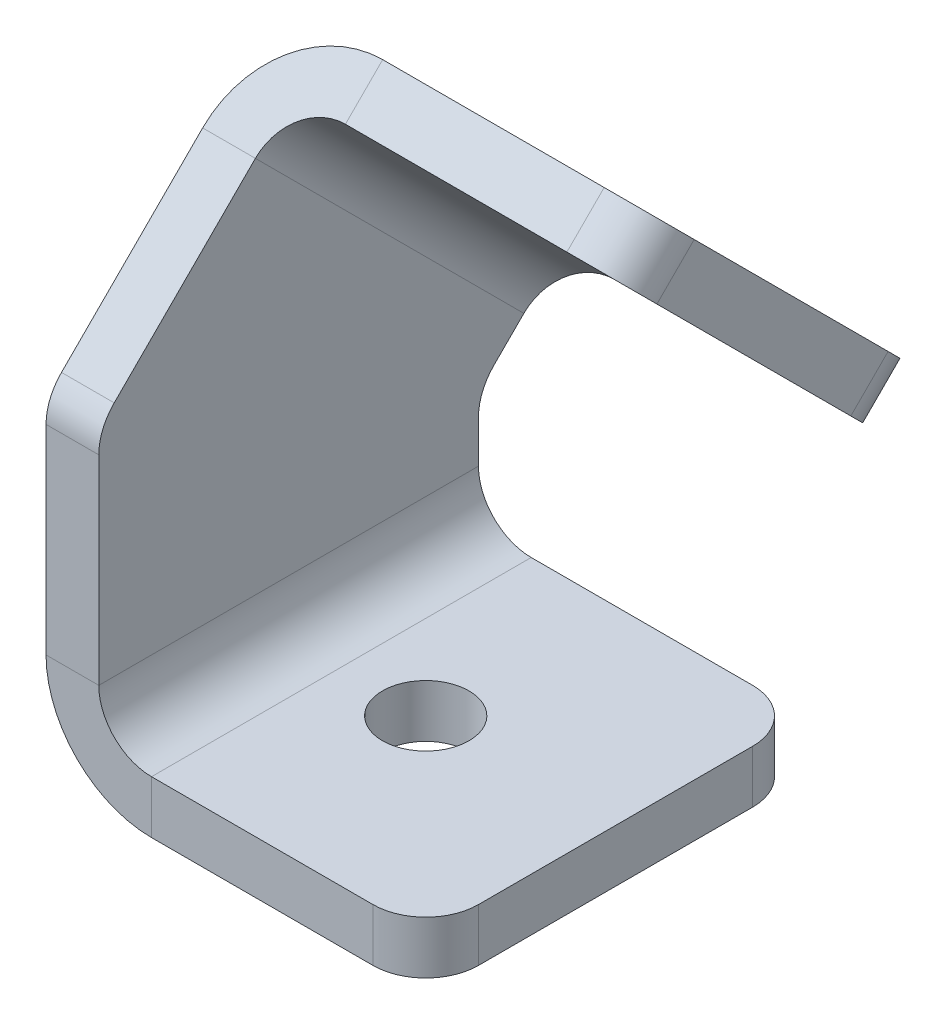
ISO-10303-21;
HEADER;
FILE_DESCRIPTION(('STEP AP214'),'2;1');
FILE_NAME('part.step','',(''),(''),'','','');
FILE_SCHEMA(('AUTOMOTIVE_DESIGN { 1 0 10303 214 1 1 1 1 }'));
ENDSEC;
DATA;
#1=APPLICATION_CONTEXT('core data for automotive mechanical design processes');
#2=APPLICATION_PROTOCOL_DEFINITION('international standard','automotive_design',2000,#1);
#3=PRODUCT_CONTEXT('',#1,'mechanical');
#4=PRODUCT('Part','Part','',(#3));
#5=PRODUCT_RELATED_PRODUCT_CATEGORY('part','',(#4));
#6=PRODUCT_DEFINITION_FORMATION('','',#4);
#7=PRODUCT_DEFINITION_CONTEXT('part definition',#1,'design');
#8=PRODUCT_DEFINITION('design','',#6,#7);
#9=PRODUCT_DEFINITION_SHAPE('','',#8);
#10=(LENGTH_UNIT() NAMED_UNIT(*) SI_UNIT(.MILLI.,.METRE.));
#11=(NAMED_UNIT(*) PLANE_ANGLE_UNIT() SI_UNIT($,.RADIAN.));
#12=(NAMED_UNIT(*) SI_UNIT($,.STERADIAN.) SOLID_ANGLE_UNIT());
#13=UNCERTAINTY_MEASURE_WITH_UNIT(LENGTH_MEASURE(1.E-05),#10,'distance_accuracy_value','');
#14=(GEOMETRIC_REPRESENTATION_CONTEXT(3) GLOBAL_UNCERTAINTY_ASSIGNED_CONTEXT((#13)) GLOBAL_UNIT_ASSIGNED_CONTEXT((#10,
#11,#12)) REPRESENTATION_CONTEXT('',''));
#15=CARTESIAN_POINT('',(0.,0.,0.));
#16=DIRECTION('',(0.,0.,1.));
#17=DIRECTION('',(1.,0.,0.));
#18=AXIS2_PLACEMENT_3D('',#15,#16,#17);
#19=CARTESIAN_POINT('',(5.,28.9289321881345,31.));
#20=DIRECTION('',(1.,0.,0.));
#21=DIRECTION('',(0.,0.,-1.));
#22=AXIS2_PLACEMENT_3D('',#19,#20,#21);
#23=CYLINDRICAL_SURFACE('',#22,5.);
#24=DIRECTION('',(1.,0.,0.));
#25=VECTOR('',#24,1.);
#26=CARTESIAN_POINT('',(5.,32.4644660940673,34.5355339059327));
#27=LINE('',#26,#25);
#28=CARTESIAN_POINT('',(0.,32.4644660940673,34.5355339059327));
#29=VERTEX_POINT('',#28);
#30=CARTESIAN_POINT('',(5.,32.4644660940673,34.5355339059327));
#31=VERTEX_POINT('',#30);
#32=EDGE_CURVE('E10',#29,#31,#27,.T.);
#33=ORIENTED_EDGE('',*,*,#32,.F.);
#34=CARTESIAN_POINT('',(0.,28.9289321881345,31.));
#35=DIRECTION('',(1.,0.,0.));
#36=DIRECTION('',(0.,0.,-1.));
#37=AXIS2_PLACEMENT_3D('',#34,#35,#36);
#38=CIRCLE('',#37,5.);
#39=CARTESIAN_POINT('',(0.,28.9289321881345,36.));
#40=VERTEX_POINT('',#39);
#41=EDGE_CURVE('E136',#29,#40,#38,.T.);
#42=ORIENTED_EDGE('',*,*,#41,.T.);
#43=DIRECTION('',(1.,0.,0.));
#44=VECTOR('',#43,1.);
#45=CARTESIAN_POINT('',(5.,28.9289321881345,36.));
#46=LINE('',#45,#44);
#47=CARTESIAN_POINT('',(5.,28.9289321881345,36.));
#48=VERTEX_POINT('',#47);
#49=EDGE_CURVE('E26',#40,#48,#46,.T.);
#50=ORIENTED_EDGE('',*,*,#49,.T.);
#51=CARTESIAN_POINT('',(5.,28.9289321881345,31.));
#52=DIRECTION('',(1.,0.,0.));
#53=DIRECTION('',(0.,0.,-1.));
#54=AXIS2_PLACEMENT_3D('',#51,#52,#53);
#55=CIRCLE('',#54,5.);
#56=EDGE_CURVE('E254',#31,#48,#55,.T.);
#57=ORIENTED_EDGE('',*,*,#56,.F.);
#58=EDGE_LOOP('',(#33,#42,#50,#57));
#59=FACE_BOUND('',#58,.T.);
#60=ADVANCED_FACE('F16',(#59),#23,.T.);
#61=CARTESIAN_POINT('',(5.,0.,36.));
#62=DIRECTION('',(0.,0.,-1.));
#63=DIRECTION('',(0.,1.,0.));
#64=AXIS2_PLACEMENT_3D('',#61,#62,#63);
#65=PLANE('',#64);
#66=ORIENTED_EDGE('',*,*,#49,.F.);
#67=DIRECTION('',(0.,1.,0.));
#68=VECTOR('',#67,1.);
#69=CARTESIAN_POINT('',(0.,0.,36.));
#70=LINE('',#69,#68);
#71=CARTESIAN_POINT('',(0.,10.,36.));
#72=VERTEX_POINT('',#71);
#73=EDGE_CURVE('E195',#40,#72,#70,.F.);
#74=ORIENTED_EDGE('',*,*,#73,.T.);
#75=DIRECTION('',(1.,0.,0.));
#76=VECTOR('',#75,1.);
#77=CARTESIAN_POINT('',(5.,10.,36.));
#78=LINE('',#77,#76);
#79=CARTESIAN_POINT('',(5.,10.,36.));
#80=VERTEX_POINT('',#79);
#81=EDGE_CURVE('E247',#72,#80,#78,.T.);
#82=ORIENTED_EDGE('',*,*,#81,.T.);
#83=DIRECTION('',(0.,1.,0.));
#84=VECTOR('',#83,1.);
#85=CARTESIAN_POINT('',(5.,0.,36.));
#86=LINE('',#85,#84);
#87=EDGE_CURVE('E264',#48,#80,#86,.F.);
#88=ORIENTED_EDGE('',*,*,#87,.F.);
#89=EDGE_LOOP('',(#66,#74,#82,#88));
#90=FACE_BOUND('',#89,.T.);
#91=ADVANCED_FACE('F267',(#90),#65,.F.);
#92=CARTESIAN_POINT('',(10.,10.,36.));
#93=DIRECTION('',(0.,0.,1.));
#94=DIRECTION('',(1.,0.,0.));
#95=AXIS2_PLACEMENT_3D('',#92,#93,#94);
#96=PLANE('',#95);
#97=ORIENTED_EDGE('',*,*,#81,.F.);
#98=CARTESIAN_POINT('',(10.,10.,36.));
#99=DIRECTION('',(0.,0.,1.));
#100=DIRECTION('',(1.,0.,0.));
#101=AXIS2_PLACEMENT_3D('',#98,#99,#100);
#102=CIRCLE('',#101,10.);
#103=CARTESIAN_POINT('',(10.,0.,36.));
#104=VERTEX_POINT('',#103);
#105=EDGE_CURVE('E170',#104,#72,#102,.F.);
#106=ORIENTED_EDGE('',*,*,#105,.F.);
#107=DIRECTION('',(0.,1.,0.));
#108=VECTOR('',#107,1.);
#109=CARTESIAN_POINT('',(10.,5.,36.));
#110=LINE('',#109,#108);
#111=CARTESIAN_POINT('',(10.,5.,36.));
#112=VERTEX_POINT('',#111);
#113=EDGE_CURVE('E244',#104,#112,#110,.T.);
#114=ORIENTED_EDGE('',*,*,#113,.T.);
#115=CARTESIAN_POINT('',(10.,10.,36.));
#116=DIRECTION('',(0.,0.,-1.));
#117=DIRECTION('',(-1.,0.,0.));
#118=AXIS2_PLACEMENT_3D('',#115,#116,#117);
#119=CIRCLE('',#118,5.);
#120=EDGE_CURVE('E279',#112,#80,#119,.T.);
#121=ORIENTED_EDGE('',*,*,#120,.T.);
#122=EDGE_LOOP('',(#97,#106,#114,#121));
#123=FACE_BOUND('',#122,.T.);
#124=ADVANCED_FACE('F336',(#123),#96,.T.);
#125=CARTESIAN_POINT('',(0.,5.,36.));
#126=DIRECTION('',(0.,0.,1.));
#127=DIRECTION('',(1.,0.,0.));
#128=AXIS2_PLACEMENT_3D('',#125,#126,#127);
#129=PLANE('',#128);
#130=ORIENTED_EDGE('',*,*,#113,.F.);
#131=DIRECTION('',(1.,0.,0.));
#132=VECTOR('',#131,1.);
#133=CARTESIAN_POINT('',(0.,0.,36.));
#134=LINE('',#133,#132);
#135=CARTESIAN_POINT('',(31.,0.,36.));
#136=VERTEX_POINT('',#135);
#137=EDGE_CURVE('E190',#104,#136,#134,.T.);
#138=ORIENTED_EDGE('',*,*,#137,.T.);
#139=DIRECTION('',(0.,1.,0.));
#140=VECTOR('',#139,1.);
#141=CARTESIAN_POINT('',(31.,5.,36.));
#142=LINE('',#141,#140);
#143=CARTESIAN_POINT('',(31.,5.,36.));
#144=VERTEX_POINT('',#143);
#145=EDGE_CURVE('E241',#136,#144,#142,.T.);
#146=ORIENTED_EDGE('',*,*,#145,.T.);
#147=DIRECTION('',(1.,0.,0.));
#148=VECTOR('',#147,1.);
#149=CARTESIAN_POINT('',(0.,5.,36.));
#150=LINE('',#149,#148);
#151=EDGE_CURVE('E388',#112,#144,#150,.T.);
#152=ORIENTED_EDGE('',*,*,#151,.F.);
#153=EDGE_LOOP('',(#130,#138,#146,#152));
#154=FACE_BOUND('',#153,.T.);
#155=ADVANCED_FACE('F600',(#154),#129,.T.);
#156=CARTESIAN_POINT('',(31.,5.,31.));
#157=DIRECTION('',(0.,1.,0.));
#158=DIRECTION('',(0.,0.,1.));
#159=AXIS2_PLACEMENT_3D('',#156,#157,#158);
#160=CYLINDRICAL_SURFACE('',#159,5.);
#161=ORIENTED_EDGE('',*,*,#145,.F.);
#162=CARTESIAN_POINT('',(31.,0.,31.));
#163=DIRECTION('',(0.,1.,0.));
#164=DIRECTION('',(0.,0.,1.));
#165=AXIS2_PLACEMENT_3D('',#162,#163,#164);
#166=CIRCLE('',#165,5.);
#167=CARTESIAN_POINT('',(36.,0.,31.));
#168=VERTEX_POINT('',#167);
#169=EDGE_CURVE('E166',#136,#168,#166,.T.);
#170=ORIENTED_EDGE('',*,*,#169,.T.);
#171=DIRECTION('',(0.,1.,0.));
#172=VECTOR('',#171,1.);
#173=CARTESIAN_POINT('',(36.,5.,31.));
#174=LINE('',#173,#172);
#175=CARTESIAN_POINT('',(36.,5.,31.));
#176=VERTEX_POINT('',#175);
#177=EDGE_CURVE('E238',#168,#176,#174,.T.);
#178=ORIENTED_EDGE('',*,*,#177,.T.);
#179=CARTESIAN_POINT('',(31.,5.,31.));
#180=DIRECTION('',(0.,1.,0.));
#181=DIRECTION('',(0.,0.,1.));
#182=AXIS2_PLACEMENT_3D('',#179,#180,#181);
#183=CIRCLE('',#182,5.);
#184=EDGE_CURVE('E384',#144,#176,#183,.T.);
#185=ORIENTED_EDGE('',*,*,#184,.F.);
#186=EDGE_LOOP('',(#161,#170,#178,#185));
#187=FACE_BOUND('',#186,.T.);
#188=ADVANCED_FACE('F591',(#187),#160,.T.);
#189=CARTESIAN_POINT('',(36.,5.,36.));
#190=DIRECTION('',(1.,0.,0.));
#191=DIRECTION('',(0.,0.,-1.));
#192=AXIS2_PLACEMENT_3D('',#189,#190,#191);
#193=PLANE('',#192);
#194=ORIENTED_EDGE('',*,*,#177,.F.);
#195=DIRECTION('',(0.,0.,1.));
#196=VECTOR('',#195,1.);
#197=CARTESIAN_POINT('',(36.,0.,36.));
#198=LINE('',#197,#196);
#199=CARTESIAN_POINT('',(36.,0.,5.));
#200=VERTEX_POINT('',#199);
#201=EDGE_CURVE('E184',#168,#200,#198,.F.);
#202=ORIENTED_EDGE('',*,*,#201,.T.);
#203=DIRECTION('',(0.,1.,0.));
#204=VECTOR('',#203,1.);
#205=CARTESIAN_POINT('',(36.,5.,5.));
#206=LINE('',#205,#204);
#207=CARTESIAN_POINT('',(36.,5.,5.));
#208=VERTEX_POINT('',#207);
#209=EDGE_CURVE('E235',#200,#208,#206,.T.);
#210=ORIENTED_EDGE('',*,*,#209,.T.);
#211=DIRECTION('',(0.,0.,-1.));
#212=VECTOR('',#211,1.);
#213=CARTESIAN_POINT('',(36.,5.,36.));
#214=LINE('',#213,#212);
#215=EDGE_CURVE('E401',#176,#208,#214,.T.);
#216=ORIENTED_EDGE('',*,*,#215,.F.);
#217=EDGE_LOOP('',(#194,#202,#210,#216));
#218=FACE_BOUND('',#217,.T.);
#219=ADVANCED_FACE('F582',(#218),#193,.T.);
#220=CARTESIAN_POINT('',(31.,5.,5.));
#221=DIRECTION('',(0.,1.,0.));
#222=DIRECTION('',(0.,0.,1.));
#223=AXIS2_PLACEMENT_3D('',#220,#221,#222);
#224=CYLINDRICAL_SURFACE('',#223,5.);
#225=ORIENTED_EDGE('',*,*,#209,.F.);
#226=CARTESIAN_POINT('',(31.,0.,5.));
#227=DIRECTION('',(0.,1.,0.));
#228=DIRECTION('',(0.,0.,1.));
#229=AXIS2_PLACEMENT_3D('',#226,#227,#228);
#230=CIRCLE('',#229,5.);
#231=CARTESIAN_POINT('',(31.,0.,0.));
#232=VERTEX_POINT('',#231);
#233=EDGE_CURVE('E181',#200,#232,#230,.T.);
#234=ORIENTED_EDGE('',*,*,#233,.T.);
#235=DIRECTION('',(0.,1.,0.));
#236=VECTOR('',#235,1.);
#237=CARTESIAN_POINT('',(31.,5.,0.));
#238=LINE('',#237,#236);
#239=CARTESIAN_POINT('',(31.,5.,0.));
#240=VERTEX_POINT('',#239);
#241=EDGE_CURVE('E232',#232,#240,#238,.T.);
#242=ORIENTED_EDGE('',*,*,#241,.T.);
#243=CARTESIAN_POINT('',(31.,5.,5.));
#244=DIRECTION('',(0.,1.,0.));
#245=DIRECTION('',(0.,0.,1.));
#246=AXIS2_PLACEMENT_3D('',#243,#244,#245);
#247=CIRCLE('',#246,5.);
#248=EDGE_CURVE('E398',#208,#240,#247,.T.);
#249=ORIENTED_EDGE('',*,*,#248,.F.);
#250=EDGE_LOOP('',(#225,#234,#242,#249));
#251=FACE_BOUND('',#250,.T.);
#252=ADVANCED_FACE('F574',(#251),#224,.T.);
#253=CARTESIAN_POINT('',(0.,5.,0.));
#254=DIRECTION('',(0.,0.,1.));
#255=DIRECTION('',(1.,0.,0.));
#256=AXIS2_PLACEMENT_3D('',#253,#254,#255);
#257=PLANE('',#256);
#258=ORIENTED_EDGE('',*,*,#241,.F.);
#259=DIRECTION('',(1.,0.,0.));
#260=VECTOR('',#259,1.);
#261=CARTESIAN_POINT('',(0.,0.,0.));
#262=LINE('',#261,#260);
#263=CARTESIAN_POINT('',(10.,0.,0.));
#264=VERTEX_POINT('',#263);
#265=EDGE_CURVE('E178',#264,#232,#262,.T.);
#266=ORIENTED_EDGE('',*,*,#265,.F.);
#267=DIRECTION('',(0.,1.,0.));
#268=VECTOR('',#267,1.);
#269=CARTESIAN_POINT('',(10.,5.,0.));
#270=LINE('',#269,#268);
#271=CARTESIAN_POINT('',(10.,5.,0.));
#272=VERTEX_POINT('',#271);
#273=EDGE_CURVE('E229',#264,#272,#270,.T.);
#274=ORIENTED_EDGE('',*,*,#273,.T.);
#275=DIRECTION('',(1.,0.,0.));
#276=VECTOR('',#275,1.);
#277=CARTESIAN_POINT('',(0.,5.,0.));
#278=LINE('',#277,#276);
#279=EDGE_CURVE('E396',#272,#240,#278,.T.);
#280=ORIENTED_EDGE('',*,*,#279,.T.);
#281=EDGE_LOOP('',(#258,#266,#274,#280));
#282=FACE_BOUND('',#281,.T.);
#283=ADVANCED_FACE('F566',(#282),#257,.F.);
#284=CARTESIAN_POINT('',(10.,10.,0.));
#285=DIRECTION('',(0.,0.,1.));
#286=DIRECTION('',(1.,0.,0.));
#287=AXIS2_PLACEMENT_3D('',#284,#285,#286);
#288=PLANE('',#287);
#289=ORIENTED_EDGE('',*,*,#273,.F.);
#290=CARTESIAN_POINT('',(10.,10.,0.));
#291=DIRECTION('',(0.,0.,1.));
#292=DIRECTION('',(1.,0.,0.));
#293=AXIS2_PLACEMENT_3D('',#290,#291,#292);
#294=CIRCLE('',#293,10.);
#295=CARTESIAN_POINT('',(0.,10.,0.));
#296=VERTEX_POINT('',#295);
#297=EDGE_CURVE('E175',#296,#264,#294,.T.);
#298=ORIENTED_EDGE('',*,*,#297,.F.);
#299=DIRECTION('',(1.,0.,0.));
#300=VECTOR('',#299,1.);
#301=CARTESIAN_POINT('',(5.,10.,0.));
#302=LINE('',#301,#300);
#303=CARTESIAN_POINT('',(5.,10.,0.));
#304=VERTEX_POINT('',#303);
#305=EDGE_CURVE('E226',#296,#304,#302,.T.);
#306=ORIENTED_EDGE('',*,*,#305,.T.);
#307=CARTESIAN_POINT('',(10.,10.,0.));
#308=DIRECTION('',(0.,0.,-1.));
#309=DIRECTION('',(-1.,0.,0.));
#310=AXIS2_PLACEMENT_3D('',#307,#308,#309);
#311=CIRCLE('',#310,5.);
#312=EDGE_CURVE('E281',#304,#272,#311,.F.);
#313=ORIENTED_EDGE('',*,*,#312,.T.);
#314=EDGE_LOOP('',(#289,#298,#306,#313));
#315=FACE_BOUND('',#314,.T.);
#316=ADVANCED_FACE('F319',(#315),#288,.F.);
#317=CARTESIAN_POINT('',(5.,0.,0.));
#318=DIRECTION('',(0.,0.,-1.));
#319=DIRECTION('',(0.,1.,0.));
#320=AXIS2_PLACEMENT_3D('',#317,#318,#319);
#321=PLANE('',#320);
#322=ORIENTED_EDGE('',*,*,#305,.F.);
#323=DIRECTION('',(0.,1.,0.));
#324=VECTOR('',#323,1.);
#325=CARTESIAN_POINT('',(0.,0.,0.));
#326=LINE('',#325,#324);
#327=CARTESIAN_POINT('',(0.,14.0172439427031,0.));
#328=VERTEX_POINT('',#327);
#329=EDGE_CURVE('E171',#328,#296,#326,.F.);
#330=ORIENTED_EDGE('',*,*,#329,.F.);
#331=DIRECTION('',(1.,0.,0.));
#332=VECTOR('',#331,1.);
#333=CARTESIAN_POINT('',(5.,14.0172439427031,0.));
#334=LINE('',#333,#332);
#335=CARTESIAN_POINT('',(5.,14.0172439427031,0.));
#336=VERTEX_POINT('',#335);
#337=EDGE_CURVE('E223',#328,#336,#334,.T.);
#338=ORIENTED_EDGE('',*,*,#337,.T.);
#339=DIRECTION('',(0.,1.,0.));
#340=VECTOR('',#339,1.);
#341=CARTESIAN_POINT('',(5.,0.,0.));
#342=LINE('',#341,#340);
#343=EDGE_CURVE('E270',#336,#304,#342,.F.);
#344=ORIENTED_EDGE('',*,*,#343,.T.);
#345=EDGE_LOOP('',(#322,#330,#338,#344));
#346=FACE_BOUND('',#345,.T.);
#347=ADVANCED_FACE('F549',(#346),#321,.T.);
#348=CARTESIAN_POINT('',(5.,14.0172439427031,-5.));
#349=DIRECTION('',(1.,0.,0.));
#350=DIRECTION('',(0.,0.,-1.));
#351=AXIS2_PLACEMENT_3D('',#348,#349,#350);
#352=CYLINDRICAL_SURFACE('',#351,5.);
#353=ORIENTED_EDGE('',*,*,#337,.F.);
#354=CARTESIAN_POINT('',(0.,14.0172439427031,-5.));
#355=DIRECTION('',(1.,0.,0.));
#356=DIRECTION('',(0.,0.,-1.));
#357=AXIS2_PLACEMENT_3D('',#354,#355,#356);
#358=CIRCLE('',#357,5.);
#359=CARTESIAN_POINT('',(0.,17.5527778486358,-1.46446609406727));
#360=VERTEX_POINT('',#359);
#361=EDGE_CURVE('E167',#328,#360,#358,.F.);
#362=ORIENTED_EDGE('',*,*,#361,.T.);
#363=DIRECTION('',(1.,0.,0.));
#364=VECTOR('',#363,1.);
#365=CARTESIAN_POINT('',(5.,17.5527778486358,-1.46446609406727));
#366=LINE('',#365,#364);
#367=CARTESIAN_POINT('',(5.,17.5527778486358,-1.46446609406727));
#368=VERTEX_POINT('',#367);
#369=EDGE_CURVE('E220',#360,#368,#366,.T.);
#370=ORIENTED_EDGE('',*,*,#369,.T.);
#371=CARTESIAN_POINT('',(5.,14.0172439427031,-5.));
#372=DIRECTION('',(1.,0.,0.));
#373=DIRECTION('',(0.,0.,-1.));
#374=AXIS2_PLACEMENT_3D('',#371,#372,#373);
#375=CIRCLE('',#374,5.);
#376=EDGE_CURVE('E276',#336,#368,#375,.F.);
#377=ORIENTED_EDGE('',*,*,#376,.F.);
#378=EDGE_LOOP('',(#353,#362,#370,#377));
#379=FACE_BOUND('',#378,.T.);
#380=ADVANCED_FACE('F544',(#379),#352,.F.);
#381=CARTESIAN_POINT('',(5.,27.4644660940672,-11.3761543394987));
#382=DIRECTION('',(0.,0.707106781186549,0.707106781186546));
#383=DIRECTION('',(0.,-0.707106781186546,0.707106781186549));
#384=AXIS2_PLACEMENT_3D('',#381,#382,#383);
#385=PLANE('',#384);
#386=ORIENTED_EDGE('',*,*,#369,.F.);
#387=DIRECTION('',(0.,-0.707106781186546,0.707106781186549));
#388=VECTOR('',#387,1.);
#389=CARTESIAN_POINT('',(0.,27.4644660940672,-11.3761543394987));
#390=LINE('',#389,#388);
#391=CARTESIAN_POINT('',(0.,20.3933982822017,-4.30508652763319));
#392=VERTEX_POINT('',#391);
#393=EDGE_CURVE('E132',#360,#392,#390,.F.);
#394=ORIENTED_EDGE('',*,*,#393,.T.);
#395=DIRECTION('',(1.,0.,0.));
#396=VECTOR('',#395,1.);
#397=CARTESIAN_POINT('',(5.,20.3933982822017,-4.30508652763319));
#398=LINE('',#397,#396);
#399=CARTESIAN_POINT('',(5.,20.3933982822017,-4.30508652763319));
#400=VERTEX_POINT('',#399);
#401=EDGE_CURVE('E217',#392,#400,#398,.T.);
#402=ORIENTED_EDGE('',*,*,#401,.T.);
#403=DIRECTION('',(0.,-0.707106781186546,0.707106781186549));
#404=VECTOR('',#403,1.);
#405=CARTESIAN_POINT('',(5.,27.4644660940672,-11.3761543394987));
#406=LINE('',#405,#404);
#407=EDGE_CURVE('E380',#368,#400,#406,.F.);
#408=ORIENTED_EDGE('',*,*,#407,.F.);
#409=EDGE_LOOP('',(#386,#394,#402,#408));
#410=FACE_BOUND('',#409,.T.);
#411=ADVANCED_FACE('F379',(#410),#385,.F.);
#412=CARTESIAN_POINT('',(10.,20.3933982822017,-4.30508652763319));
#413=DIRECTION('',(0.,0.707106781186549,0.707106781186546));
#414=DIRECTION('',(0.,-0.707106781186546,0.707106781186549));
#415=AXIS2_PLACEMENT_3D('',#412,#413,#414);
#416=PLANE('',#415);
#417=ORIENTED_EDGE('',*,*,#401,.F.);
#418=CARTESIAN_POINT('',(10.,20.3933982822017,-4.3050865276332));
#419=DIRECTION('',(0.,0.707106781186549,0.707106781186546));
#420=DIRECTION('',(0.,-0.707106781186546,0.707106781186549));
#421=AXIS2_PLACEMENT_3D('',#418,#419,#420);
#422=CIRCLE('',#421,10.);
#423=CARTESIAN_POINT('',(10.,27.4644660940672,-11.3761543394987));
#424=VERTEX_POINT('',#423);
#425=EDGE_CURVE('E128',#424,#392,#422,.T.);
#426=ORIENTED_EDGE('',*,*,#425,.F.);
#427=DIRECTION('',(0.,-0.707106781186546,0.707106781186549));
#428=VECTOR('',#427,1.);
#429=CARTESIAN_POINT('',(10.,23.9289321881345,-7.84062043356594));
#430=LINE('',#429,#428);
#431=CARTESIAN_POINT('',(10.,23.9289321881345,-7.84062043356594));
#432=VERTEX_POINT('',#431);
#433=EDGE_CURVE('E34',#424,#432,#430,.T.);
#434=ORIENTED_EDGE('',*,*,#433,.T.);
#435=CARTESIAN_POINT('',(10.,20.3933982822017,-4.30508652763319));
#436=DIRECTION('',(0.,-0.707106781186549,-0.707106781186546));
#437=DIRECTION('',(0.,0.707106781186546,-0.707106781186549));
#438=AXIS2_PLACEMENT_3D('',#435,#436,#437);
#439=CIRCLE('',#438,5.);
#440=EDGE_CURVE('E118',#432,#400,#439,.F.);
#441=ORIENTED_EDGE('',*,*,#440,.T.);
#442=EDGE_LOOP('',(#417,#426,#434,#441));
#443=FACE_BOUND('',#442,.T.);
#444=ADVANCED_FACE('F373',(#443),#416,.F.);
#445=CARTESIAN_POINT('',(0.,23.9289321881345,-7.84062043356594));
#446=DIRECTION('',(0.,-0.707106781186549,-0.707106781186546));
#447=DIRECTION('',(1.,0.,0.));
#448=AXIS2_PLACEMENT_3D('',#445,#446,#447);
#449=PLANE('',#448);
#450=ORIENTED_EDGE('',*,*,#433,.F.);
#451=DIRECTION('',(-1.,0.,0.));
#452=VECTOR('',#451,1.);
#453=CARTESIAN_POINT('',(0.,27.4644660940672,-11.3761543394987));
#454=LINE('',#453,#452);
#455=CARTESIAN_POINT('',(31.,27.4644660940672,-11.3761543394987));
#456=VERTEX_POINT('',#455);
#457=EDGE_CURVE('E161',#424,#456,#454,.F.);
#458=ORIENTED_EDGE('',*,*,#457,.T.);
#459=DIRECTION('',(0.,-0.707106781186546,0.707106781186549));
#460=VECTOR('',#459,1.);
#461=CARTESIAN_POINT('',(31.,23.9289321881345,-7.84062043356594));
#462=LINE('',#461,#460);
#463=CARTESIAN_POINT('',(31.,23.9289321881345,-7.84062043356594));
#464=VERTEX_POINT('',#463);
#465=EDGE_CURVE('E213',#456,#464,#462,.T.);
#466=ORIENTED_EDGE('',*,*,#465,.T.);
#467=DIRECTION('',(1.,0.,0.));
#468=VECTOR('',#467,1.);
#469=CARTESIAN_POINT('',(0.,23.9289321881345,-7.84062043356594));
#470=LINE('',#469,#468);
#471=EDGE_CURVE('E287',#432,#464,#470,.T.);
#472=ORIENTED_EDGE('',*,*,#471,.F.);
#473=EDGE_LOOP('',(#450,#458,#466,#472));
#474=FACE_BOUND('',#473,.T.);
#475=ADVANCED_FACE('F538',(#474),#449,.T.);
#476=CARTESIAN_POINT('',(31.,27.4644660940672,-4.30508652763321));
#477=DIRECTION('',(0.,-0.707106781186546,0.707106781186549));
#478=DIRECTION('',(0.,-0.707106781186549,-0.707106781186546));
#479=AXIS2_PLACEMENT_3D('',#476,#477,#478);
#480=CYLINDRICAL_SURFACE('',#479,5.);
#481=ORIENTED_EDGE('',*,*,#465,.F.);
#482=CARTESIAN_POINT('',(31.,30.9999999999999,-7.84062043356595));
#483=DIRECTION('',(0.,-0.707106781186546,0.707106781186549));
#484=DIRECTION('',(0.,-0.707106781186549,-0.707106781186546));
#485=AXIS2_PLACEMENT_3D('',#482,#483,#484);
#486=CIRCLE('',#485,5.);
#487=CARTESIAN_POINT('',(36.,30.9999999999999,-7.84062043356596));
#488=VERTEX_POINT('',#487);
#489=EDGE_CURVE('E158',#456,#488,#486,.T.);
#490=ORIENTED_EDGE('',*,*,#489,.T.);
#491=DIRECTION('',(0.,-0.707106781186546,0.707106781186549));
#492=VECTOR('',#491,1.);
#493=CARTESIAN_POINT('',(36.,27.4644660940672,-4.30508652763321));
#494=LINE('',#493,#492);
#495=CARTESIAN_POINT('',(36.,27.4644660940672,-4.30508652763321));
#496=VERTEX_POINT('',#495);
#497=EDGE_CURVE('E210',#488,#496,#494,.T.);
#498=ORIENTED_EDGE('',*,*,#497,.T.);
#499=CARTESIAN_POINT('',(31.,27.4644660940672,-4.30508652763321));
#500=DIRECTION('',(0.,-0.707106781186546,0.707106781186549));
#501=DIRECTION('',(0.,-0.707106781186549,-0.707106781186546));
#502=AXIS2_PLACEMENT_3D('',#499,#500,#501);
#503=CIRCLE('',#502,5.);
#504=EDGE_CURVE('E290',#464,#496,#503,.T.);
#505=ORIENTED_EDGE('',*,*,#504,.F.);
#506=EDGE_LOOP('',(#481,#490,#498,#505));
#507=FACE_BOUND('',#506,.T.);
#508=ADVANCED_FACE('F529',(#507),#480,.T.);
#509=CARTESIAN_POINT('',(36.,49.3847763108502,17.6152236891497));
#510=DIRECTION('',(-1.,0.,0.));
#511=DIRECTION('',(0.,-0.707106781186549,-0.707106781186546));
#512=AXIS2_PLACEMENT_3D('',#509,#510,#511);
#513=PLANE('',#512);
#514=ORIENTED_EDGE('',*,*,#497,.F.);
#515=DIRECTION('',(0.,0.707106781186549,0.707106781186546));
#516=VECTOR('',#515,1.);
#517=CARTESIAN_POINT('',(36.,52.9203102167829,14.079689783217));
#518=LINE('',#517,#516);
#519=CARTESIAN_POINT('',(36.,49.3847763108502,10.5441558772843));
#520=VERTEX_POINT('',#519);
#521=EDGE_CURVE('E155',#520,#488,#518,.F.);
#522=ORIENTED_EDGE('',*,*,#521,.F.);
#523=DIRECTION('',(0.,-0.707106781186546,0.707106781186549));
#524=VECTOR('',#523,1.);
#525=CARTESIAN_POINT('',(36.,45.8492424049175,14.079689783217));
#526=LINE('',#525,#524);
#527=CARTESIAN_POINT('',(36.,45.8492424049175,14.079689783217));
#528=VERTEX_POINT('',#527);
#529=EDGE_CURVE('E207',#520,#528,#526,.T.);
#530=ORIENTED_EDGE('',*,*,#529,.T.);
#531=DIRECTION('',(0.,-0.707106781186549,-0.707106781186546));
#532=VECTOR('',#531,1.);
#533=CARTESIAN_POINT('',(36.,49.3847763108502,17.6152236891497));
#534=LINE('',#533,#532);
#535=EDGE_CURVE('E293',#528,#496,#534,.T.);
#536=ORIENTED_EDGE('',*,*,#535,.T.);
#537=EDGE_LOOP('',(#514,#522,#530,#536));
#538=FACE_BOUND('',#537,.T.);
#539=ADVANCED_FACE('F521',(#538),#513,.F.);
#540=CARTESIAN_POINT('',(31.,45.8492424049175,14.079689783217));
#541=DIRECTION('',(0.,-0.707106781186546,0.707106781186549));
#542=DIRECTION('',(0.,-0.707106781186549,-0.707106781186546));
#543=AXIS2_PLACEMENT_3D('',#540,#541,#542);
#544=CYLINDRICAL_SURFACE('',#543,5.);
#545=ORIENTED_EDGE('',*,*,#529,.F.);
#546=CARTESIAN_POINT('',(31.,49.3847763108502,10.5441558772843));
#547=DIRECTION('',(0.,-0.707106781186546,0.707106781186549));
#548=DIRECTION('',(0.,-0.707106781186549,-0.707106781186546));
#549=AXIS2_PLACEMENT_3D('',#546,#547,#548);
#550=CIRCLE('',#549,5.);
#551=CARTESIAN_POINT('',(31.,52.9203102167829,14.079689783217));
#552=VERTEX_POINT('',#551);
#553=EDGE_CURVE('E152',#520,#552,#550,.T.);
#554=ORIENTED_EDGE('',*,*,#553,.T.);
#555=DIRECTION('',(0.,-0.707106781186546,0.707106781186549));
#556=VECTOR('',#555,1.);
#557=CARTESIAN_POINT('',(31.,49.3847763108502,17.6152236891497));
#558=LINE('',#557,#556);
#559=CARTESIAN_POINT('',(31.,49.3847763108502,17.6152236891497));
#560=VERTEX_POINT('',#559);
#561=EDGE_CURVE('E204',#552,#560,#558,.T.);
#562=ORIENTED_EDGE('',*,*,#561,.T.);
#563=CARTESIAN_POINT('',(31.,45.8492424049175,14.079689783217));
#564=DIRECTION('',(0.,-0.707106781186546,0.707106781186549));
#565=DIRECTION('',(0.,-0.707106781186549,-0.707106781186546));
#566=AXIS2_PLACEMENT_3D('',#563,#564,#565);
#567=CIRCLE('',#566,5.);
#568=EDGE_CURVE('E296',#528,#560,#567,.T.);
#569=ORIENTED_EDGE('',*,*,#568,.F.);
#570=EDGE_LOOP('',(#545,#554,#562,#569));
#571=FACE_BOUND('',#570,.T.);
#572=ADVANCED_FACE('F359',(#571),#544,.T.);
#573=CARTESIAN_POINT('',(0.,49.3847763108502,17.6152236891497));
#574=DIRECTION('',(0.,-0.707106781186549,-0.707106781186546));
#575=DIRECTION('',(1.,0.,0.));
#576=AXIS2_PLACEMENT_3D('',#573,#574,#575);
#577=PLANE('',#576);
#578=ORIENTED_EDGE('',*,*,#561,.F.);
#579=DIRECTION('',(-1.,0.,0.));
#580=VECTOR('',#579,1.);
#581=CARTESIAN_POINT('',(0.,52.9203102167829,14.079689783217));
#582=LINE('',#581,#580);
#583=CARTESIAN_POINT('',(10.,52.9203102167829,14.079689783217));
#584=VERTEX_POINT('',#583);
#585=EDGE_CURVE('E144',#584,#552,#582,.F.);
#586=ORIENTED_EDGE('',*,*,#585,.F.);
#587=DIRECTION('',(0.,-0.707106781186546,0.707106781186549));
#588=VECTOR('',#587,1.);
#589=CARTESIAN_POINT('',(10.,49.3847763108502,17.6152236891497));
#590=LINE('',#589,#588);
#591=CARTESIAN_POINT('',(10.,49.3847763108502,17.6152236891497));
#592=VERTEX_POINT('',#591);
#593=EDGE_CURVE('E117',#584,#592,#590,.T.);
#594=ORIENTED_EDGE('',*,*,#593,.T.);
#595=DIRECTION('',(1.,0.,0.));
#596=VECTOR('',#595,1.);
#597=CARTESIAN_POINT('',(0.,49.3847763108502,17.6152236891497));
#598=LINE('',#597,#596);
#599=EDGE_CURVE('E299',#592,#560,#598,.T.);
#600=ORIENTED_EDGE('',*,*,#599,.T.);
#601=EDGE_LOOP('',(#578,#586,#594,#600));
#602=FACE_BOUND('',#601,.T.);
#603=ADVANCED_FACE('F366',(#602),#577,.F.);
#604=CARTESIAN_POINT('',(10.,45.8492424049175,21.1507575950825));
#605=DIRECTION('',(0.,0.707106781186549,0.707106781186546));
#606=DIRECTION('',(0.,-0.707106781186546,0.707106781186549));
#607=AXIS2_PLACEMENT_3D('',#604,#605,#606);
#608=PLANE('',#607);
#609=ORIENTED_EDGE('',*,*,#593,.F.);
#610=CARTESIAN_POINT('',(10.,45.8492424049175,21.1507575950825));
#611=DIRECTION('',(0.,0.707106781186549,0.707106781186546));
#612=DIRECTION('',(0.,-0.707106781186546,0.707106781186549));
#613=AXIS2_PLACEMENT_3D('',#610,#611,#612);
#614=CIRCLE('',#613,10.);
#615=CARTESIAN_POINT('',(0.,45.8492424049175,21.1507575950825));
#616=VERTEX_POINT('',#615);
#617=EDGE_CURVE('E126',#616,#584,#614,.F.);
#618=ORIENTED_EDGE('',*,*,#617,.F.);
#619=DIRECTION('',(1.,0.,0.));
#620=VECTOR('',#619,1.);
#621=CARTESIAN_POINT('',(5.,45.8492424049175,21.1507575950825));
#622=LINE('',#621,#620);
#623=CARTESIAN_POINT('',(5.,45.8492424049175,21.1507575950825));
#624=VERTEX_POINT('',#623);
#625=EDGE_CURVE('E20',#616,#624,#622,.T.);
#626=ORIENTED_EDGE('',*,*,#625,.T.);
#627=CARTESIAN_POINT('',(10.,45.8492424049175,21.1507575950825));
#628=DIRECTION('',(0.,-0.707106781186549,-0.707106781186546));
#629=DIRECTION('',(0.,0.707106781186546,-0.707106781186549));
#630=AXIS2_PLACEMENT_3D('',#627,#628,#629);
#631=CIRCLE('',#630,5.);
#632=EDGE_CURVE('E305',#624,#592,#631,.T.);
#633=ORIENTED_EDGE('',*,*,#632,.T.);
#634=EDGE_LOOP('',(#609,#618,#626,#633));
#635=FACE_BOUND('',#634,.T.);
#636=ADVANCED_FACE('F138',(#635),#608,.T.);
#637=CARTESIAN_POINT('',(18.,5.,18.));
#638=DIRECTION('',(0.,1.,0.));
#639=DIRECTION('',(0.,0.,1.));
#640=AXIS2_PLACEMENT_3D('',#637,#638,#639);
#641=CYLINDRICAL_SURFACE('',#640,4.1);
#642=CARTESIAN_POINT('',(18.,5.,18.));
#643=DIRECTION('',(0.,1.,0.));
#644=DIRECTION('',(0.,0.,1.));
#645=AXIS2_PLACEMENT_3D('',#642,#643,#644);
#646=CIRCLE('',#645,4.1);
#647=CARTESIAN_POINT('',(18.,5.,22.1));
#648=VERTEX_POINT('',#647);
#649=EDGE_CURVE('E142',#648,#648,#646,.F.);
#650=ORIENTED_EDGE('',*,*,#649,.F.);
#651=EDGE_LOOP('',(#650));
#652=FACE_BOUND('',#651,.T.);
#653=CARTESIAN_POINT('',(18.,0.,18.));
#654=DIRECTION('',(0.,1.,0.));
#655=DIRECTION('',(0.,0.,1.));
#656=AXIS2_PLACEMENT_3D('',#653,#654,#655);
#657=CIRCLE('',#656,4.1);
#658=CARTESIAN_POINT('',(18.,0.,22.1));
#659=VERTEX_POINT('',#658);
#660=EDGE_CURVE('E187',#659,#659,#657,.F.);
#661=ORIENTED_EDGE('',*,*,#660,.T.);
#662=EDGE_LOOP('',(#661));
#663=FACE_BOUND('',#662,.T.);
#664=ADVANCED_FACE('F18',(#652,#663),#641,.F.);
#665=CARTESIAN_POINT('',(18.,36.6568542494923,4.88730162779189));
#666=DIRECTION('',(0.,-0.707106781186546,0.707106781186549));
#667=DIRECTION('',(0.,-0.707106781186549,-0.707106781186546));
#668=AXIS2_PLACEMENT_3D('',#665,#666,#667);
#669=CYLINDRICAL_SURFACE('',#668,4.1);
#670=CARTESIAN_POINT('',(18.,36.6568542494923,4.88730162779189));
#671=DIRECTION('',(0.,0.707106781186546,-0.707106781186549));
#672=DIRECTION('',(0.,0.707106781186549,0.707106781186546));
#673=AXIS2_PLACEMENT_3D('',#670,#671,#672);
#674=CIRCLE('',#673,4.1);
#675=CARTESIAN_POINT('',(18.,39.5559920523572,7.78643943065673));
#676=VERTEX_POINT('',#675);
#677=EDGE_CURVE('E284',#676,#676,#674,.F.);
#678=ORIENTED_EDGE('',*,*,#677,.T.);
#679=EDGE_LOOP('',(#678));
#680=FACE_BOUND('',#679,.T.);
#681=CARTESIAN_POINT('',(18.,40.1923881554251,1.35176772185915));
#682=DIRECTION('',(0.,0.707106781186546,-0.707106781186549));
#683=DIRECTION('',(0.,0.707106781186549,0.707106781186546));
#684=AXIS2_PLACEMENT_3D('',#681,#682,#683);
#685=CIRCLE('',#684,4.1);
#686=CARTESIAN_POINT('',(18.,43.0915259582899,4.25090552472399));
#687=VERTEX_POINT('',#686);
#688=EDGE_CURVE('E163',#687,#687,#685,.F.);
#689=ORIENTED_EDGE('',*,*,#688,.F.);
#690=EDGE_LOOP('',(#689));
#691=FACE_BOUND('',#690,.T.);
#692=ADVANCED_FACE('F412',(#680,#691),#669,.F.);
#693=CARTESIAN_POINT('',(5.,52.9203102167829,14.079689783217));
#694=DIRECTION('',(0.,0.707106781186549,0.707106781186546));
#695=DIRECTION('',(0.,-0.707106781186546,0.707106781186549));
#696=AXIS2_PLACEMENT_3D('',#693,#694,#695);
#697=PLANE('',#696);
#698=DIRECTION('',(0.,-0.707106781186546,0.707106781186549));
#699=VECTOR('',#698,1.);
#700=CARTESIAN_POINT('',(0.,52.9203102167829,14.079689783217));
#701=LINE('',#700,#699);
#702=EDGE_CURVE('E108',#29,#616,#701,.F.);
#703=ORIENTED_EDGE('',*,*,#702,.F.);
#704=ORIENTED_EDGE('',*,*,#32,.T.);
#705=DIRECTION('',(0.,-0.707106781186546,0.707106781186549));
#706=VECTOR('',#705,1.);
#707=CARTESIAN_POINT('',(5.,52.9203102167829,14.079689783217));
#708=LINE('',#707,#706);
#709=EDGE_CURVE('E111',#31,#624,#708,.F.);
#710=ORIENTED_EDGE('',*,*,#709,.T.);
#711=ORIENTED_EDGE('',*,*,#625,.F.);
#712=EDGE_LOOP('',(#703,#704,#710,#711));
#713=FACE_BOUND('',#712,.T.);
#714=ADVANCED_FACE('F106',(#713),#697,.T.);
#715=CARTESIAN_POINT('',(10.,45.8492424049175,21.1507575950825));
#716=DIRECTION('',(0.,0.707106781186549,0.707106781186546));
#717=DIRECTION('',(0.,-0.707106781186546,0.707106781186549));
#718=AXIS2_PLACEMENT_3D('',#715,#716,#717);
#719=CYLINDRICAL_SURFACE('',#718,5.);
#720=ORIENTED_EDGE('',*,*,#632,.F.);
#721=DIRECTION('',(0.,-0.707106781186549,-0.707106781186546));
#722=VECTOR('',#721,1.);
#723=CARTESIAN_POINT('',(5.,45.8492424049175,21.1507575950825));
#724=LINE('',#723,#722);
#725=EDGE_CURVE('E383',#400,#624,#724,.F.);
#726=ORIENTED_EDGE('',*,*,#725,.F.);
#727=ORIENTED_EDGE('',*,*,#440,.F.);
#728=DIRECTION('',(0.,-0.707106781186549,-0.707106781186546));
#729=VECTOR('',#728,1.);
#730=CARTESIAN_POINT('',(10.,23.9289321881345,-7.84062043356595));
#731=LINE('',#730,#729);
#732=EDGE_CURVE('E302',#592,#432,#731,.T.);
#733=ORIENTED_EDGE('',*,*,#732,.F.);
#734=EDGE_LOOP('',(#720,#726,#727,#733));
#735=FACE_BOUND('',#734,.T.);
#736=ADVANCED_FACE('F432',(#735),#719,.F.);
#737=CARTESIAN_POINT('',(0.,49.3847763108502,17.6152236891497));
#738=DIRECTION('',(0.,-0.707106781186546,0.707106781186549));
#739=DIRECTION('',(0.,0.707106781186549,0.707106781186546));
#740=AXIS2_PLACEMENT_3D('',#737,#738,#739);
#741=PLANE('',#740);
#742=ORIENTED_EDGE('',*,*,#677,.F.);
#743=EDGE_LOOP('',(#742));
#744=FACE_BOUND('',#743,.T.);
#745=ORIENTED_EDGE('',*,*,#471,.T.);
#746=ORIENTED_EDGE('',*,*,#504,.T.);
#747=ORIENTED_EDGE('',*,*,#535,.F.);
#748=ORIENTED_EDGE('',*,*,#568,.T.);
#749=ORIENTED_EDGE('',*,*,#599,.F.);
#750=ORIENTED_EDGE('',*,*,#732,.T.);
#751=EDGE_LOOP('',(#745,#746,#747,#748,#749,#750));
#752=FACE_BOUND('',#751,.T.);
#753=ADVANCED_FACE('F365',(#744,#752),#741,.T.);
#754=CARTESIAN_POINT('',(10.,10.,36.));
#755=DIRECTION('',(0.,0.,1.));
#756=DIRECTION('',(1.,0.,0.));
#757=AXIS2_PLACEMENT_3D('',#754,#755,#756);
#758=CYLINDRICAL_SURFACE('',#757,5.);
#759=ORIENTED_EDGE('',*,*,#120,.F.);
#760=DIRECTION('',(0.,0.,-1.));
#761=VECTOR('',#760,1.);
#762=CARTESIAN_POINT('',(10.,5.,36.));
#763=LINE('',#762,#761);
#764=EDGE_CURVE('E393',#272,#112,#763,.F.);
#765=ORIENTED_EDGE('',*,*,#764,.F.);
#766=ORIENTED_EDGE('',*,*,#312,.F.);
#767=DIRECTION('',(0.,0.,-1.));
#768=VECTOR('',#767,1.);
#769=CARTESIAN_POINT('',(5.,10.,0.));
#770=LINE('',#769,#768);
#771=EDGE_CURVE('E268',#80,#304,#770,.T.);
#772=ORIENTED_EDGE('',*,*,#771,.F.);
#773=EDGE_LOOP('',(#759,#765,#766,#772));
#774=FACE_BOUND('',#773,.T.);
#775=ADVANCED_FACE('F343',(#774),#758,.F.);
#776=CARTESIAN_POINT('',(5.,0.,36.));
#777=DIRECTION('',(1.,0.,0.));
#778=DIRECTION('',(0.,0.,-1.));
#779=AXIS2_PLACEMENT_3D('',#776,#777,#778);
#780=PLANE('',#779);
#781=ORIENTED_EDGE('',*,*,#407,.T.);
#782=ORIENTED_EDGE('',*,*,#725,.T.);
#783=ORIENTED_EDGE('',*,*,#709,.F.);
#784=ORIENTED_EDGE('',*,*,#56,.T.);
#785=ORIENTED_EDGE('',*,*,#87,.T.);
#786=ORIENTED_EDGE('',*,*,#771,.T.);
#787=ORIENTED_EDGE('',*,*,#343,.F.);
#788=ORIENTED_EDGE('',*,*,#376,.T.);
#789=EDGE_LOOP('',(#781,#782,#783,#784,#785,#786,#787,#788));
#790=FACE_BOUND('',#789,.T.);
#791=ADVANCED_FACE('F262',(#790),#780,.T.);
#792=CARTESIAN_POINT('',(0.,5.,36.));
#793=DIRECTION('',(0.,1.,0.));
#794=DIRECTION('',(0.,0.,1.));
#795=AXIS2_PLACEMENT_3D('',#792,#793,#794);
#796=PLANE('',#795);
#797=ORIENTED_EDGE('',*,*,#649,.T.);
#798=EDGE_LOOP('',(#797));
#799=FACE_BOUND('',#798,.T.);
#800=ORIENTED_EDGE('',*,*,#215,.T.);
#801=ORIENTED_EDGE('',*,*,#248,.T.);
#802=ORIENTED_EDGE('',*,*,#279,.F.);
#803=ORIENTED_EDGE('',*,*,#764,.T.);
#804=ORIENTED_EDGE('',*,*,#151,.T.);
#805=ORIENTED_EDGE('',*,*,#184,.T.);
#806=EDGE_LOOP('',(#800,#801,#802,#803,#804,#805));
#807=FACE_BOUND('',#806,.T.);
#808=ADVANCED_FACE('F407',(#799,#807),#796,.T.);
#809=CARTESIAN_POINT('',(10.,45.8492424049175,21.1507575950825));
#810=DIRECTION('',(0.,0.707106781186549,0.707106781186546));
#811=DIRECTION('',(0.,-0.707106781186546,0.707106781186549));
#812=AXIS2_PLACEMENT_3D('',#809,#810,#811);
#813=CYLINDRICAL_SURFACE('',#812,10.);
#814=ORIENTED_EDGE('',*,*,#617,.T.);
#815=DIRECTION('',(0.,0.707106781186549,0.707106781186546));
#816=VECTOR('',#815,1.);
#817=CARTESIAN_POINT('',(10.,52.9203102167829,14.079689783217));
#818=LINE('',#817,#816);
#819=EDGE_CURVE('E140',#584,#424,#818,.F.);
#820=ORIENTED_EDGE('',*,*,#819,.T.);
#821=ORIENTED_EDGE('',*,*,#425,.T.);
#822=DIRECTION('',(0.,0.707106781186549,0.707106781186546));
#823=VECTOR('',#822,1.);
#824=CARTESIAN_POINT('',(0.,45.8492424049175,21.1507575950825));
#825=LINE('',#824,#823);
#826=EDGE_CURVE('E123',#392,#616,#825,.T.);
#827=ORIENTED_EDGE('',*,*,#826,.T.);
#828=EDGE_LOOP('',(#814,#820,#821,#827));
#829=FACE_BOUND('',#828,.T.);
#830=ADVANCED_FACE('F124',(#829),#813,.T.);
#831=CARTESIAN_POINT('',(0.,52.9203102167829,14.079689783217));
#832=DIRECTION('',(0.,-0.707106781186546,0.707106781186549));
#833=DIRECTION('',(0.,0.707106781186549,0.707106781186546));
#834=AXIS2_PLACEMENT_3D('',#831,#832,#833);
#835=PLANE('',#834);
#836=ORIENTED_EDGE('',*,*,#688,.T.);
#837=EDGE_LOOP('',(#836));
#838=FACE_BOUND('',#837,.T.);
#839=ORIENTED_EDGE('',*,*,#457,.F.);
#840=ORIENTED_EDGE('',*,*,#819,.F.);
#841=ORIENTED_EDGE('',*,*,#585,.T.);
#842=ORIENTED_EDGE('',*,*,#553,.F.);
#843=ORIENTED_EDGE('',*,*,#521,.T.);
#844=ORIENTED_EDGE('',*,*,#489,.F.);
#845=EDGE_LOOP('',(#839,#840,#841,#842,#843,#844));
#846=FACE_BOUND('',#845,.T.);
#847=ADVANCED_FACE('F369',(#838,#846),#835,.F.);
#848=CARTESIAN_POINT('',(10.,10.,36.));
#849=DIRECTION('',(0.,0.,1.));
#850=DIRECTION('',(1.,0.,0.));
#851=AXIS2_PLACEMENT_3D('',#848,#849,#850);
#852=CYLINDRICAL_SURFACE('',#851,10.);
#853=ORIENTED_EDGE('',*,*,#105,.T.);
#854=DIRECTION('',(0.,0.,-1.));
#855=VECTOR('',#854,1.);
#856=CARTESIAN_POINT('',(0.,10.,36.));
#857=LINE('',#856,#855);
#858=EDGE_CURVE('E174',#72,#296,#857,.T.);
#859=ORIENTED_EDGE('',*,*,#858,.T.);
#860=ORIENTED_EDGE('',*,*,#297,.T.);
#861=DIRECTION('',(0.,0.,1.));
#862=VECTOR('',#861,1.);
#863=CARTESIAN_POINT('',(10.,0.,36.));
#864=LINE('',#863,#862);
#865=EDGE_CURVE('E148',#264,#104,#864,.T.);
#866=ORIENTED_EDGE('',*,*,#865,.T.);
#867=EDGE_LOOP('',(#853,#859,#860,#866));
#868=FACE_BOUND('',#867,.T.);
#869=ADVANCED_FACE('F310',(#868),#852,.T.);
#870=CARTESIAN_POINT('',(0.,0.,36.));
#871=DIRECTION('',(1.,0.,0.));
#872=DIRECTION('',(0.,0.,-1.));
#873=AXIS2_PLACEMENT_3D('',#870,#871,#872);
#874=PLANE('',#873);
#875=ORIENTED_EDGE('',*,*,#393,.F.);
#876=ORIENTED_EDGE('',*,*,#361,.F.);
#877=ORIENTED_EDGE('',*,*,#329,.T.);
#878=ORIENTED_EDGE('',*,*,#858,.F.);
#879=ORIENTED_EDGE('',*,*,#73,.F.);
#880=ORIENTED_EDGE('',*,*,#41,.F.);
#881=ORIENTED_EDGE('',*,*,#702,.T.);
#882=ORIENTED_EDGE('',*,*,#826,.F.);
#883=EDGE_LOOP('',(#875,#876,#877,#878,#879,#880,#881,#882));
#884=FACE_BOUND('',#883,.T.);
#885=ADVANCED_FACE('F134',(#884),#874,.F.);
#886=CARTESIAN_POINT('',(0.,0.,36.));
#887=DIRECTION('',(0.,1.,0.));
#888=DIRECTION('',(0.,0.,1.));
#889=AXIS2_PLACEMENT_3D('',#886,#887,#888);
#890=PLANE('',#889);
#891=ORIENTED_EDGE('',*,*,#660,.F.);
#892=EDGE_LOOP('',(#891));
#893=FACE_BOUND('',#892,.T.);
#894=ORIENTED_EDGE('',*,*,#201,.F.);
#895=ORIENTED_EDGE('',*,*,#169,.F.);
#896=ORIENTED_EDGE('',*,*,#137,.F.);
#897=ORIENTED_EDGE('',*,*,#865,.F.);
#898=ORIENTED_EDGE('',*,*,#265,.T.);
#899=ORIENTED_EDGE('',*,*,#233,.F.);
#900=EDGE_LOOP('',(#894,#895,#896,#897,#898,#899));
#901=FACE_BOUND('',#900,.T.);
#902=ADVANCED_FACE('F331',(#893,#901),#890,.F.);
#903=CLOSED_SHELL('',(#60,#91,#124,#155,#188,#219,#252,#283,#316,#347,#380,#411,#444,#475,#508,
#539,#572,#603,#636,#664,#692,#714,#736,#753,#775,#791,#808,#830,#847,#869,#885,#902));
#904=MANIFOLD_SOLID_BREP('B1',#903);
#905=ADVANCED_BREP_SHAPE_REPRESENTATION('',(#18,#904),#14);
#906=SHAPE_DEFINITION_REPRESENTATION(#9,#905);
ENDSEC;
END-ISO-10303-21;
